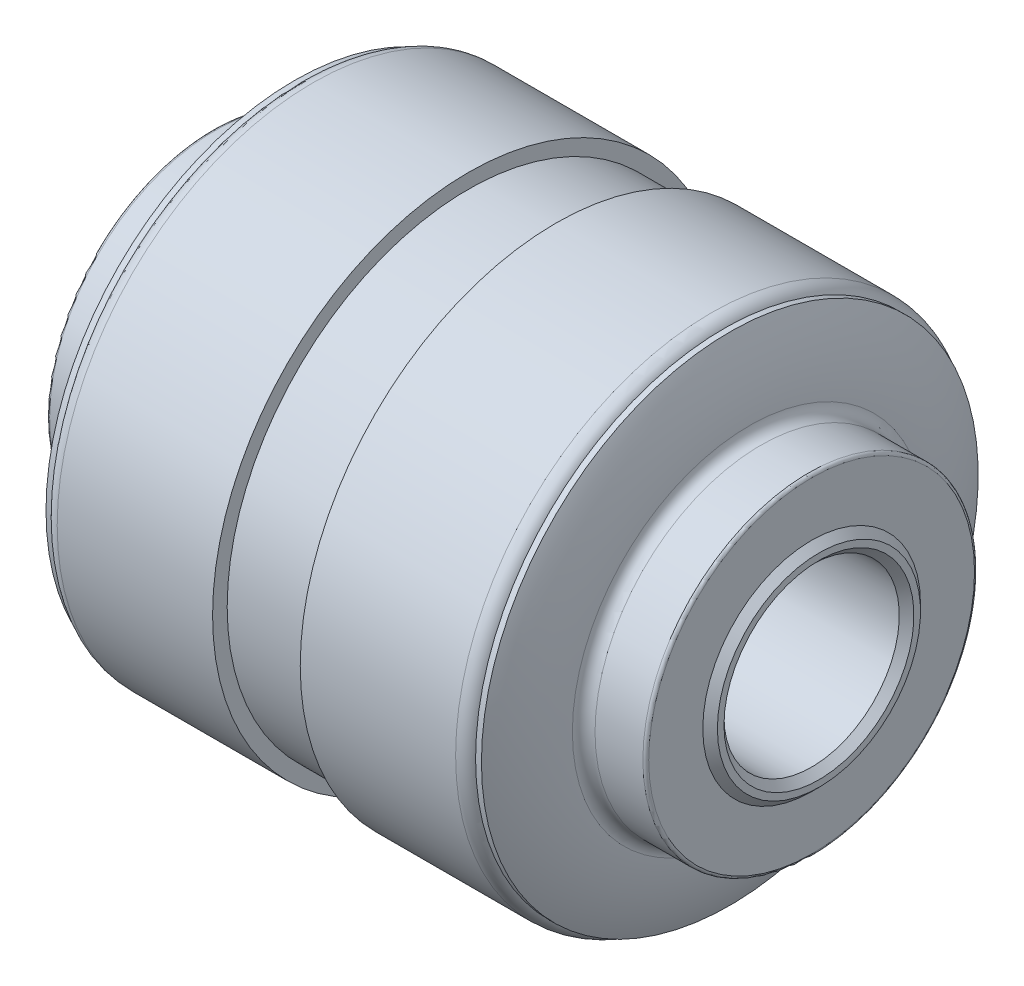
ISO-10303-21;
HEADER;
FILE_DESCRIPTION(('STEP AP214'),'2;1');
FILE_NAME('part.step','',(''),(''),'','','');
FILE_SCHEMA(('AUTOMOTIVE_DESIGN { 1 0 10303 214 1 1 1 1 }'));
ENDSEC;
DATA;
#1=APPLICATION_CONTEXT('core data for automotive mechanical design processes');
#2=APPLICATION_PROTOCOL_DEFINITION('international standard','automotive_design',2000,#1);
#3=PRODUCT_CONTEXT('',#1,'mechanical');
#4=PRODUCT('Part','Part','',(#3));
#5=PRODUCT_RELATED_PRODUCT_CATEGORY('part','',(#4));
#6=PRODUCT_DEFINITION_FORMATION('','',#4);
#7=PRODUCT_DEFINITION_CONTEXT('part definition',#1,'design');
#8=PRODUCT_DEFINITION('design','',#6,#7);
#9=PRODUCT_DEFINITION_SHAPE('','',#8);
#10=(LENGTH_UNIT() NAMED_UNIT(*) SI_UNIT(.MILLI.,.METRE.));
#11=(NAMED_UNIT(*) PLANE_ANGLE_UNIT() SI_UNIT($,.RADIAN.));
#12=(NAMED_UNIT(*) SI_UNIT($,.STERADIAN.) SOLID_ANGLE_UNIT());
#13=UNCERTAINTY_MEASURE_WITH_UNIT(LENGTH_MEASURE(1.E-05),#10,'distance_accuracy_value','');
#14=(GEOMETRIC_REPRESENTATION_CONTEXT(3) GLOBAL_UNCERTAINTY_ASSIGNED_CONTEXT((#13)) GLOBAL_UNIT_ASSIGNED_CONTEXT((#10,
#11,#12)) REPRESENTATION_CONTEXT('',''));
#15=CARTESIAN_POINT('',(0.,0.,0.));
#16=DIRECTION('',(0.,0.,1.));
#17=DIRECTION('',(1.,0.,0.));
#18=AXIS2_PLACEMENT_3D('',#15,#16,#17);
#19=CARTESIAN_POINT('',(88.99,0.,0.));
#20=DIRECTION('',(1.,0.,0.));
#21=DIRECTION('',(0.,0.,1.));
#22=AXIS2_PLACEMENT_3D('',#19,#20,#21);
#23=CYLINDRICAL_SURFACE('',#22,17.);
#24=CARTESIAN_POINT('',(-14.5,0.,0.));
#25=DIRECTION('',(-1.,0.,0.));
#26=DIRECTION('',(0.,0.,1.));
#27=AXIS2_PLACEMENT_3D('',#24,#25,#26);
#28=CIRCLE('',#27,17.);
#29=CARTESIAN_POINT('',(-14.5,0.,17.));
#30=VERTEX_POINT('',#29);
#31=EDGE_CURVE('E113',#30,#30,#28,.T.);
#32=ORIENTED_EDGE('',*,*,#31,.T.);
#33=EDGE_LOOP('',(#32));
#34=FACE_BOUND('',#33,.T.);
#35=CARTESIAN_POINT('',(-14.9002242129923,0.,0.));
#36=DIRECTION('',(1.,0.,0.));
#37=DIRECTION('',(0.,0.,-1.));
#38=AXIS2_PLACEMENT_3D('',#35,#36,#37);
#39=CIRCLE('',#38,17.);
#40=CARTESIAN_POINT('',(-14.9002242129923,0.,-17.));
#41=VERTEX_POINT('',#40);
#42=EDGE_CURVE('E92',#41,#41,#39,.F.);
#43=ORIENTED_EDGE('',*,*,#42,.F.);
#44=EDGE_LOOP('',(#43));
#45=FACE_BOUND('',#44,.T.);
#46=ADVANCED_FACE('F35',(#34,#45),#23,.T.);
#47=CARTESIAN_POINT('',(-88.99,0.,0.));
#48=DIRECTION('',(-1.,0.,0.));
#49=DIRECTION('',(0.,0.,1.));
#50=AXIS2_PLACEMENT_3D('',#47,#48,#49);
#51=CYLINDRICAL_SURFACE('',#50,17.);
#52=CARTESIAN_POINT('',(14.5,0.,0.));
#53=DIRECTION('',(-1.,0.,0.));
#54=DIRECTION('',(0.,0.,1.));
#55=AXIS2_PLACEMENT_3D('',#52,#53,#54);
#56=CIRCLE('',#55,17.);
#57=CARTESIAN_POINT('',(14.5,0.,17.));
#58=VERTEX_POINT('',#57);
#59=EDGE_CURVE('E103',#58,#58,#56,.T.);
#60=ORIENTED_EDGE('',*,*,#59,.F.);
#61=EDGE_LOOP('',(#60));
#62=FACE_BOUND('',#61,.T.);
#63=CARTESIAN_POINT('',(14.9002242129923,0.,0.));
#64=DIRECTION('',(-1.,0.,0.));
#65=DIRECTION('',(0.,0.,1.));
#66=AXIS2_PLACEMENT_3D('',#63,#64,#65);
#67=CIRCLE('',#66,17.);
#68=CARTESIAN_POINT('',(14.9002242129923,0.,17.));
#69=VERTEX_POINT('',#68);
#70=EDGE_CURVE('E96',#69,#69,#67,.F.);
#71=ORIENTED_EDGE('',*,*,#70,.F.);
#72=EDGE_LOOP('',(#71));
#73=FACE_BOUND('',#72,.T.);
#74=ADVANCED_FACE('F142',(#62,#73),#51,.T.);
#75=CARTESIAN_POINT('',(-88.99,0.,0.));
#76=DIRECTION('',(-1.,0.,0.));
#77=DIRECTION('',(0.,0.,1.));
#78=AXIS2_PLACEMENT_3D('',#75,#76,#77);
#79=CYLINDRICAL_SURFACE('',#78,6.);
#80=CARTESIAN_POINT('',(-20.5,0.,0.));
#81=DIRECTION('',(1.,0.,0.));
#82=DIRECTION('',(0.,0.,-1.));
#83=AXIS2_PLACEMENT_3D('',#80,#81,#82);
#84=CIRCLE('',#83,6.);
#85=CARTESIAN_POINT('',(-20.5,0.,-6.));
#86=VERTEX_POINT('',#85);
#87=EDGE_CURVE('E85',#86,#86,#84,.F.);
#88=ORIENTED_EDGE('',*,*,#87,.T.);
#89=EDGE_LOOP('',(#88));
#90=FACE_BOUND('',#89,.T.);
#91=CARTESIAN_POINT('',(20.5,0.,0.));
#92=DIRECTION('',(-1.,0.,0.));
#93=DIRECTION('',(0.,0.,1.));
#94=AXIS2_PLACEMENT_3D('',#91,#92,#93);
#95=CIRCLE('',#94,6.);
#96=CARTESIAN_POINT('',(20.5,0.,6.));
#97=VERTEX_POINT('',#96);
#98=EDGE_CURVE('E88',#97,#97,#95,.F.);
#99=ORIENTED_EDGE('',*,*,#98,.T.);
#100=EDGE_LOOP('',(#99));
#101=FACE_BOUND('',#100,.T.);
#102=ADVANCED_FACE('F148',(#90,#101),#79,.F.);
#103=CARTESIAN_POINT('',(21.,6.,0.));
#104=DIRECTION('',(-1.,0.,0.));
#105=DIRECTION('',(0.,0.,1.));
#106=AXIS2_PLACEMENT_3D('',#103,#104,#105);
#107=PLANE('',#106);
#108=CARTESIAN_POINT('',(21.,0.,0.));
#109=DIRECTION('',(-1.,0.,0.));
#110=DIRECTION('',(0.,0.,1.));
#111=AXIS2_PLACEMENT_3D('',#108,#109,#110);
#112=CIRCLE('',#111,6.49999999999999);
#113=CARTESIAN_POINT('',(21.,0.,6.49999999999999));
#114=VERTEX_POINT('',#113);
#115=EDGE_CURVE('E73',#114,#114,#112,.T.);
#116=ORIENTED_EDGE('',*,*,#115,.T.);
#117=EDGE_LOOP('',(#116));
#118=FACE_BOUND('',#117,.T.);
#119=CARTESIAN_POINT('',(21.,0.,0.));
#120=DIRECTION('',(-1.,0.,0.));
#121=DIRECTION('',(0.,0.,1.));
#122=AXIS2_PLACEMENT_3D('',#119,#120,#121);
#123=CIRCLE('',#122,6.94999999999999);
#124=CARTESIAN_POINT('',(21.,0.,6.94999999999999));
#125=VERTEX_POINT('',#124);
#126=EDGE_CURVE('E76',#125,#125,#123,.F.);
#127=ORIENTED_EDGE('',*,*,#126,.T.);
#128=EDGE_LOOP('',(#127));
#129=FACE_BOUND('',#128,.T.);
#130=ADVANCED_FACE('F323',(#118,#129),#107,.F.);
#131=CARTESIAN_POINT('',(20.5,7.45,0.));
#132=DIRECTION('',(-1.,0.,0.));
#133=DIRECTION('',(0.,0.,1.));
#134=AXIS2_PLACEMENT_3D('',#131,#132,#133);
#135=PLANE('',#134);
#136=CARTESIAN_POINT('',(20.5,0.,0.));
#137=DIRECTION('',(-1.,0.,0.));
#138=DIRECTION('',(0.,0.,1.));
#139=AXIS2_PLACEMENT_3D('',#136,#137,#138);
#140=CIRCLE('',#139,11.15);
#141=CARTESIAN_POINT('',(20.5,0.,11.15));
#142=VERTEX_POINT('',#141);
#143=EDGE_CURVE('E61',#142,#142,#140,.F.);
#144=ORIENTED_EDGE('',*,*,#143,.T.);
#145=EDGE_LOOP('',(#144));
#146=FACE_BOUND('',#145,.T.);
#147=CARTESIAN_POINT('',(20.5,0.,0.));
#148=DIRECTION('',(-1.,0.,0.));
#149=DIRECTION('',(0.,0.,1.));
#150=AXIS2_PLACEMENT_3D('',#147,#148,#149);
#151=CIRCLE('',#150,7.45);
#152=CARTESIAN_POINT('',(20.5,0.,7.45));
#153=VERTEX_POINT('',#152);
#154=EDGE_CURVE('E91',#153,#153,#151,.T.);
#155=ORIENTED_EDGE('',*,*,#154,.T.);
#156=EDGE_LOOP('',(#155));
#157=FACE_BOUND('',#156,.T.);
#158=ADVANCED_FACE('F295',(#146,#157),#135,.F.);
#159=CARTESIAN_POINT('',(-88.99,0.,0.));
#160=DIRECTION('',(-1.,0.,0.));
#161=DIRECTION('',(0.,0.,1.));
#162=AXIS2_PLACEMENT_3D('',#159,#160,#161);
#163=CYLINDRICAL_SURFACE('',#162,11.35);
#164=CARTESIAN_POINT('',(17.0259180473517,0.,0.));
#165=DIRECTION('',(-1.,0.,0.));
#166=DIRECTION('',(0.,0.,1.));
#167=AXIS2_PLACEMENT_3D('',#164,#165,#166);
#168=CIRCLE('',#167,11.35);
#169=CARTESIAN_POINT('',(17.0259180473517,0.,11.35));
#170=VERTEX_POINT('',#169);
#171=EDGE_CURVE('E46',#170,#170,#168,.F.);
#172=ORIENTED_EDGE('',*,*,#171,.T.);
#173=EDGE_LOOP('',(#172));
#174=FACE_BOUND('',#173,.T.);
#175=CARTESIAN_POINT('',(20.3,0.,0.));
#176=DIRECTION('',(-1.,0.,0.));
#177=DIRECTION('',(0.,0.,1.));
#178=AXIS2_PLACEMENT_3D('',#175,#176,#177);
#179=CIRCLE('',#178,11.35);
#180=CARTESIAN_POINT('',(20.3,0.,11.35));
#181=VERTEX_POINT('',#180);
#182=EDGE_CURVE('E64',#181,#181,#179,.T.);
#183=ORIENTED_EDGE('',*,*,#182,.T.);
#184=EDGE_LOOP('',(#183));
#185=FACE_BOUND('',#184,.T.);
#186=ADVANCED_FACE('F248',(#174,#185),#163,.T.);
#187=CARTESIAN_POINT('',(-88.99,0.,0.));
#188=DIRECTION('',(-1.,0.,0.));
#189=DIRECTION('',(0.,0.,1.));
#190=AXIS2_PLACEMENT_3D('',#187,#188,#189);
#191=CYLINDRICAL_SURFACE('',#190,17.5);
#192=CARTESIAN_POINT('',(13.6339745962156,0.,0.));
#193=DIRECTION('',(1.,0.,0.));
#194=DIRECTION('',(0.,0.,-1.));
#195=AXIS2_PLACEMENT_3D('',#192,#193,#194);
#196=CIRCLE('',#195,17.5);
#197=CARTESIAN_POINT('',(13.6339745962156,0.,-17.5));
#198=VERTEX_POINT('',#197);
#199=EDGE_CURVE('E42',#198,#198,#196,.F.);
#200=ORIENTED_EDGE('',*,*,#199,.T.);
#201=EDGE_LOOP('',(#200));
#202=FACE_BOUND('',#201,.T.);
#203=CARTESIAN_POINT('',(3.,0.,0.));
#204=DIRECTION('',(-1.,0.,0.));
#205=DIRECTION('',(0.,0.,1.));
#206=AXIS2_PLACEMENT_3D('',#203,#204,#205);
#207=CIRCLE('',#206,17.5);
#208=CARTESIAN_POINT('',(3.,0.,17.5));
#209=VERTEX_POINT('',#208);
#210=EDGE_CURVE('E106',#209,#209,#207,.T.);
#211=ORIENTED_EDGE('',*,*,#210,.F.);
#212=EDGE_LOOP('',(#211));
#213=FACE_BOUND('',#212,.T.);
#214=ADVANCED_FACE('F138',(#202,#213),#191,.T.);
#215=CARTESIAN_POINT('',(3.,17.5,0.));
#216=DIRECTION('',(1.,0.,0.));
#217=DIRECTION('',(0.,0.,-1.));
#218=AXIS2_PLACEMENT_3D('',#215,#216,#217);
#219=PLANE('',#218);
#220=CARTESIAN_POINT('',(3.,0.,0.));
#221=DIRECTION('',(-1.,0.,0.));
#222=DIRECTION('',(0.,0.,1.));
#223=AXIS2_PLACEMENT_3D('',#220,#221,#222);
#224=CIRCLE('',#223,16.5);
#225=CARTESIAN_POINT('',(3.,0.,16.5));
#226=VERTEX_POINT('',#225);
#227=EDGE_CURVE('E99',#226,#226,#224,.T.);
#228=ORIENTED_EDGE('',*,*,#227,.F.);
#229=EDGE_LOOP('',(#228));
#230=FACE_BOUND('',#229,.T.);
#231=ORIENTED_EDGE('',*,*,#210,.T.);
#232=EDGE_LOOP('',(#231));
#233=FACE_BOUND('',#232,.T.);
#234=ADVANCED_FACE('F128',(#230,#233),#219,.F.);
#235=CARTESIAN_POINT('',(-88.99,0.,0.));
#236=DIRECTION('',(-1.,0.,0.));
#237=DIRECTION('',(0.,0.,1.));
#238=AXIS2_PLACEMENT_3D('',#235,#236,#237);
#239=CYLINDRICAL_SURFACE('',#238,16.5);
#240=ORIENTED_EDGE('',*,*,#227,.T.);
#241=EDGE_LOOP('',(#240));
#242=FACE_BOUND('',#241,.T.);
#243=CARTESIAN_POINT('',(-3.,0.,0.));
#244=DIRECTION('',(-1.,0.,0.));
#245=DIRECTION('',(0.,0.,1.));
#246=AXIS2_PLACEMENT_3D('',#243,#244,#245);
#247=CIRCLE('',#246,16.5);
#248=CARTESIAN_POINT('',(-3.,0.,16.5));
#249=VERTEX_POINT('',#248);
#250=EDGE_CURVE('E95',#249,#249,#247,.T.);
#251=ORIENTED_EDGE('',*,*,#250,.F.);
#252=EDGE_LOOP('',(#251));
#253=FACE_BOUND('',#252,.T.);
#254=ADVANCED_FACE('F125',(#242,#253),#239,.T.);
#255=CARTESIAN_POINT('',(3.75,0.,0.));
#256=DIRECTION('',(-1.,0.,0.));
#257=DIRECTION('',(0.,0.,1.));
#258=AXIS2_PLACEMENT_3D('',#255,#256,#257);
#259=DEGENERATE_TOROIDAL_SURFACE('',#258,11.35,12.5,.T.);
#260=CARTESIAN_POINT('',(16.2273665858573,0.,0.));
#261=DIRECTION('',(-1.,0.,0.));
#262=DIRECTION('',(0.,0.,1.));
#263=AXIS2_PLACEMENT_3D('',#260,#261,#262);
#264=CIRCLE('',#263,12.1018796992481);
#265=CARTESIAN_POINT('',(16.2273665858573,0.,12.1018796992481));
#266=VERTEX_POINT('',#265);
#267=EDGE_CURVE('E50',#266,#266,#264,.T.);
#268=ORIENTED_EDGE('',*,*,#267,.T.);
#269=EDGE_LOOP('',(#268));
#270=FACE_BOUND('',#269,.T.);
#271=ORIENTED_EDGE('',*,*,#70,.T.);
#272=EDGE_LOOP('',(#271));
#273=FACE_BOUND('',#272,.T.);
#274=ADVANCED_FACE('F127',(#270,#273),#259,.T.);
#275=CARTESIAN_POINT('',(-21.,6.,0.));
#276=DIRECTION('',(1.,0.,0.));
#277=DIRECTION('',(0.,0.,1.));
#278=AXIS2_PLACEMENT_3D('',#275,#276,#277);
#279=PLANE('',#278);
#280=CARTESIAN_POINT('',(-21.,0.,0.));
#281=DIRECTION('',(1.,0.,0.));
#282=DIRECTION('',(0.,0.,-1.));
#283=AXIS2_PLACEMENT_3D('',#280,#281,#282);
#284=CIRCLE('',#283,6.5);
#285=CARTESIAN_POINT('',(-21.,0.,-6.5));
#286=VERTEX_POINT('',#285);
#287=EDGE_CURVE('E79',#286,#286,#284,.T.);
#288=ORIENTED_EDGE('',*,*,#287,.T.);
#289=EDGE_LOOP('',(#288));
#290=FACE_BOUND('',#289,.T.);
#291=CARTESIAN_POINT('',(-21.,0.,0.));
#292=DIRECTION('',(1.,0.,0.));
#293=DIRECTION('',(0.,0.,-1.));
#294=AXIS2_PLACEMENT_3D('',#291,#292,#293);
#295=CIRCLE('',#294,6.95);
#296=CARTESIAN_POINT('',(-21.,0.,-6.95));
#297=VERTEX_POINT('',#296);
#298=EDGE_CURVE('E82',#297,#297,#295,.F.);
#299=ORIENTED_EDGE('',*,*,#298,.T.);
#300=EDGE_LOOP('',(#299));
#301=FACE_BOUND('',#300,.T.);
#302=ADVANCED_FACE('F135',(#290,#301),#279,.F.);
#303=CARTESIAN_POINT('',(-20.5,7.45,0.));
#304=DIRECTION('',(1.,0.,0.));
#305=DIRECTION('',(0.,0.,1.));
#306=AXIS2_PLACEMENT_3D('',#303,#304,#305);
#307=PLANE('',#306);
#308=CARTESIAN_POINT('',(-20.5,0.,0.));
#309=DIRECTION('',(1.,0.,0.));
#310=DIRECTION('',(0.,0.,-1.));
#311=AXIS2_PLACEMENT_3D('',#308,#309,#310);
#312=CIRCLE('',#311,11.15);
#313=CARTESIAN_POINT('',(-20.5,0.,-11.15));
#314=VERTEX_POINT('',#313);
#315=EDGE_CURVE('E70',#314,#314,#312,.F.);
#316=ORIENTED_EDGE('',*,*,#315,.T.);
#317=EDGE_LOOP('',(#316));
#318=FACE_BOUND('',#317,.T.);
#319=CARTESIAN_POINT('',(-20.5,0.,0.));
#320=DIRECTION('',(-1.,0.,0.));
#321=DIRECTION('',(0.,0.,1.));
#322=AXIS2_PLACEMENT_3D('',#319,#320,#321);
#323=CIRCLE('',#322,7.45);
#324=CARTESIAN_POINT('',(-20.5,0.,7.45));
#325=VERTEX_POINT('',#324);
#326=EDGE_CURVE('E100',#325,#325,#323,.T.);
#327=ORIENTED_EDGE('',*,*,#326,.F.);
#328=EDGE_LOOP('',(#327));
#329=FACE_BOUND('',#328,.T.);
#330=ADVANCED_FACE('F159',(#318,#329),#307,.F.);
#331=CARTESIAN_POINT('',(88.99,0.,0.));
#332=DIRECTION('',(1.,0.,0.));
#333=DIRECTION('',(0.,0.,1.));
#334=AXIS2_PLACEMENT_3D('',#331,#332,#333);
#335=CYLINDRICAL_SURFACE('',#334,11.35);
#336=CARTESIAN_POINT('',(-17.0259180473517,0.,0.));
#337=DIRECTION('',(-1.,0.,0.));
#338=DIRECTION('',(0.,0.,1.));
#339=AXIS2_PLACEMENT_3D('',#336,#337,#338);
#340=CIRCLE('',#339,11.35);
#341=CARTESIAN_POINT('',(-17.0259180473517,0.,11.35));
#342=VERTEX_POINT('',#341);
#343=EDGE_CURVE('E58',#342,#342,#340,.T.);
#344=ORIENTED_EDGE('',*,*,#343,.T.);
#345=EDGE_LOOP('',(#344));
#346=FACE_BOUND('',#345,.T.);
#347=CARTESIAN_POINT('',(-20.3,0.,0.));
#348=DIRECTION('',(1.,0.,0.));
#349=DIRECTION('',(0.,0.,-1.));
#350=AXIS2_PLACEMENT_3D('',#347,#348,#349);
#351=CIRCLE('',#350,11.35);
#352=CARTESIAN_POINT('',(-20.3,0.,-11.35));
#353=VERTEX_POINT('',#352);
#354=EDGE_CURVE('E67',#353,#353,#351,.T.);
#355=ORIENTED_EDGE('',*,*,#354,.T.);
#356=EDGE_LOOP('',(#355));
#357=FACE_BOUND('',#356,.T.);
#358=ADVANCED_FACE('F156',(#346,#357),#335,.T.);
#359=CARTESIAN_POINT('',(88.99,0.,0.));
#360=DIRECTION('',(1.,0.,0.));
#361=DIRECTION('',(0.,0.,1.));
#362=AXIS2_PLACEMENT_3D('',#359,#360,#361);
#363=CYLINDRICAL_SURFACE('',#362,17.5);
#364=CARTESIAN_POINT('',(-13.6339745962156,0.,0.));
#365=DIRECTION('',(-1.,0.,0.));
#366=DIRECTION('',(0.,0.,1.));
#367=AXIS2_PLACEMENT_3D('',#364,#365,#366);
#368=CIRCLE('',#367,17.5);
#369=CARTESIAN_POINT('',(-13.6339745962156,0.,17.5));
#370=VERTEX_POINT('',#369);
#371=EDGE_CURVE('E11',#370,#370,#368,.F.);
#372=ORIENTED_EDGE('',*,*,#371,.T.);
#373=EDGE_LOOP('',(#372));
#374=FACE_BOUND('',#373,.T.);
#375=CARTESIAN_POINT('',(-3.,0.,0.));
#376=DIRECTION('',(-1.,0.,0.));
#377=DIRECTION('',(0.,0.,1.));
#378=AXIS2_PLACEMENT_3D('',#375,#376,#377);
#379=CIRCLE('',#378,17.5);
#380=CARTESIAN_POINT('',(-3.,0.,17.5));
#381=VERTEX_POINT('',#380);
#382=EDGE_CURVE('E116',#381,#381,#379,.T.);
#383=ORIENTED_EDGE('',*,*,#382,.T.);
#384=EDGE_LOOP('',(#383));
#385=FACE_BOUND('',#384,.T.);
#386=ADVANCED_FACE('F154',(#374,#385),#363,.T.);
#387=CARTESIAN_POINT('',(-3.,17.5,0.));
#388=DIRECTION('',(-1.,0.,0.));
#389=DIRECTION('',(0.,0.,-1.));
#390=AXIS2_PLACEMENT_3D('',#387,#388,#389);
#391=PLANE('',#390);
#392=ORIENTED_EDGE('',*,*,#250,.T.);
#393=EDGE_LOOP('',(#392));
#394=FACE_BOUND('',#393,.T.);
#395=ORIENTED_EDGE('',*,*,#382,.F.);
#396=EDGE_LOOP('',(#395));
#397=FACE_BOUND('',#396,.T.);
#398=ADVANCED_FACE('F122',(#394,#397),#391,.F.);
#399=CARTESIAN_POINT('',(-3.75,0.,0.));
#400=DIRECTION('',(1.,0.,0.));
#401=DIRECTION('',(0.,0.,1.));
#402=AXIS2_PLACEMENT_3D('',#399,#400,#401);
#403=DEGENERATE_TOROIDAL_SURFACE('',#402,11.35,12.5,.T.);
#404=CARTESIAN_POINT('',(-16.2273665858573,0.,0.));
#405=DIRECTION('',(1.,0.,0.));
#406=DIRECTION('',(0.,0.,-1.));
#407=AXIS2_PLACEMENT_3D('',#404,#405,#406);
#408=CIRCLE('',#407,12.1018796992481);
#409=CARTESIAN_POINT('',(-16.2273665858573,0.,-12.1018796992481));
#410=VERTEX_POINT('',#409);
#411=EDGE_CURVE('E55',#410,#410,#408,.T.);
#412=ORIENTED_EDGE('',*,*,#411,.T.);
#413=EDGE_LOOP('',(#412));
#414=FACE_BOUND('',#413,.T.);
#415=ORIENTED_EDGE('',*,*,#42,.T.);
#416=EDGE_LOOP('',(#415));
#417=FACE_BOUND('',#416,.T.);
#418=ADVANCED_FACE('F185',(#414,#417),#403,.T.);
#419=CARTESIAN_POINT('',(-20.5,0.,0.));
#420=DIRECTION('',(-1.,0.,0.));
#421=DIRECTION('',(0.,0.,1.));
#422=AXIS2_PLACEMENT_3D('',#419,#420,#421);
#423=CONICAL_SURFACE('',#422,6.,0.785398163397447);
#424=ORIENTED_EDGE('',*,*,#287,.F.);
#425=EDGE_LOOP('',(#424));
#426=FACE_BOUND('',#425,.T.);
#427=ORIENTED_EDGE('',*,*,#87,.F.);
#428=EDGE_LOOP('',(#427));
#429=FACE_BOUND('',#428,.T.);
#430=ADVANCED_FACE('F175',(#426,#429),#423,.F.);
#431=CARTESIAN_POINT('',(-21.,0.,0.));
#432=DIRECTION('',(1.,0.,0.));
#433=DIRECTION('',(0.,0.,-1.));
#434=AXIS2_PLACEMENT_3D('',#431,#432,#433);
#435=CONICAL_SURFACE('',#434,6.95,0.78539816339745);
#436=ORIENTED_EDGE('',*,*,#326,.T.);
#437=EDGE_LOOP('',(#436));
#438=FACE_BOUND('',#437,.T.);
#439=ORIENTED_EDGE('',*,*,#298,.F.);
#440=EDGE_LOOP('',(#439));
#441=FACE_BOUND('',#440,.T.);
#442=ADVANCED_FACE('F172',(#438,#441),#435,.T.);
#443=CARTESIAN_POINT('',(21.,0.,0.));
#444=DIRECTION('',(1.,0.,0.));
#445=DIRECTION('',(0.,0.,-1.));
#446=AXIS2_PLACEMENT_3D('',#443,#444,#445);
#447=CONICAL_SURFACE('',#446,6.5,0.785398163397446);
#448=ORIENTED_EDGE('',*,*,#98,.F.);
#449=EDGE_LOOP('',(#448));
#450=FACE_BOUND('',#449,.T.);
#451=ORIENTED_EDGE('',*,*,#115,.F.);
#452=EDGE_LOOP('',(#451));
#453=FACE_BOUND('',#452,.T.);
#454=ADVANCED_FACE('F174',(#450,#453),#447,.F.);
#455=CARTESIAN_POINT('',(20.5,0.,0.));
#456=DIRECTION('',(-1.,0.,0.));
#457=DIRECTION('',(0.,0.,1.));
#458=AXIS2_PLACEMENT_3D('',#455,#456,#457);
#459=CONICAL_SURFACE('',#458,7.45,0.78539816339745);
#460=ORIENTED_EDGE('',*,*,#126,.F.);
#461=EDGE_LOOP('',(#460));
#462=FACE_BOUND('',#461,.T.);
#463=ORIENTED_EDGE('',*,*,#154,.F.);
#464=EDGE_LOOP('',(#463));
#465=FACE_BOUND('',#464,.T.);
#466=ADVANCED_FACE('F182',(#462,#465),#459,.T.);
#467=CARTESIAN_POINT('',(-20.3,0.,0.));
#468=DIRECTION('',(1.,0.,0.));
#469=DIRECTION('',(0.,0.,-1.));
#470=AXIS2_PLACEMENT_3D('',#467,#468,#469);
#471=TOROIDAL_SURFACE('',#470,11.15,0.2);
#472=ORIENTED_EDGE('',*,*,#354,.F.);
#473=EDGE_LOOP('',(#472));
#474=FACE_BOUND('',#473,.T.);
#475=ORIENTED_EDGE('',*,*,#315,.F.);
#476=EDGE_LOOP('',(#475));
#477=FACE_BOUND('',#476,.T.);
#478=ADVANCED_FACE('F192',(#474,#477),#471,.T.);
#479=CARTESIAN_POINT('',(20.3,0.,0.));
#480=DIRECTION('',(-1.,0.,0.));
#481=DIRECTION('',(0.,0.,1.));
#482=AXIS2_PLACEMENT_3D('',#479,#480,#481);
#483=TOROIDAL_SURFACE('',#482,11.15,0.2);
#484=ORIENTED_EDGE('',*,*,#143,.F.);
#485=EDGE_LOOP('',(#484));
#486=FACE_BOUND('',#485,.T.);
#487=ORIENTED_EDGE('',*,*,#182,.F.);
#488=EDGE_LOOP('',(#487));
#489=FACE_BOUND('',#488,.T.);
#490=ADVANCED_FACE('F196',(#486,#489),#483,.T.);
#491=CARTESIAN_POINT('',(-17.0259180473518,0.,0.));
#492=DIRECTION('',(-1.,0.,0.));
#493=DIRECTION('',(0.,0.,1.));
#494=AXIS2_PLACEMENT_3D('',#491,#492,#493);
#495=TOROIDAL_SURFACE('',#494,12.15,0.8);
#496=ORIENTED_EDGE('',*,*,#411,.F.);
#497=EDGE_LOOP('',(#496));
#498=FACE_BOUND('',#497,.T.);
#499=ORIENTED_EDGE('',*,*,#343,.F.);
#500=EDGE_LOOP('',(#499));
#501=FACE_BOUND('',#500,.T.);
#502=ADVANCED_FACE('F200',(#498,#501),#495,.F.);
#503=CARTESIAN_POINT('',(17.0259180473518,0.,0.));
#504=DIRECTION('',(-1.,0.,0.));
#505=DIRECTION('',(0.,0.,1.));
#506=AXIS2_PLACEMENT_3D('',#503,#504,#505);
#507=TOROIDAL_SURFACE('',#506,12.15,0.8);
#508=ORIENTED_EDGE('',*,*,#171,.F.);
#509=EDGE_LOOP('',(#508));
#510=FACE_BOUND('',#509,.T.);
#511=ORIENTED_EDGE('',*,*,#267,.F.);
#512=EDGE_LOOP('',(#511));
#513=FACE_BOUND('',#512,.T.);
#514=ADVANCED_FACE('F204',(#510,#513),#507,.F.);
#515=CARTESIAN_POINT('',(13.6339745962156,0.,0.));
#516=DIRECTION('',(1.,0.,0.));
#517=DIRECTION('',(0.,0.,-1.));
#518=AXIS2_PLACEMENT_3D('',#515,#516,#517);
#519=TOROIDAL_SURFACE('',#518,16.5,1.);
#520=ORIENTED_EDGE('',*,*,#59,.T.);
#521=EDGE_LOOP('',(#520));
#522=FACE_BOUND('',#521,.T.);
#523=ORIENTED_EDGE('',*,*,#199,.F.);
#524=EDGE_LOOP('',(#523));
#525=FACE_BOUND('',#524,.T.);
#526=ADVANCED_FACE('F207',(#522,#525),#519,.T.);
#527=CARTESIAN_POINT('',(-13.6339745962156,0.,0.));
#528=DIRECTION('',(-1.,0.,0.));
#529=DIRECTION('',(0.,0.,1.));
#530=AXIS2_PLACEMENT_3D('',#527,#528,#529);
#531=TOROIDAL_SURFACE('',#530,16.5,1.);
#532=ORIENTED_EDGE('',*,*,#371,.F.);
#533=EDGE_LOOP('',(#532));
#534=FACE_BOUND('',#533,.T.);
#535=ORIENTED_EDGE('',*,*,#31,.F.);
#536=EDGE_LOOP('',(#535));
#537=FACE_BOUND('',#536,.T.);
#538=ADVANCED_FACE('F37',(#534,#537),#531,.T.);
#539=CLOSED_SHELL('',(#46,#74,#102,#130,#158,#186,#214,#234,#254,#274,#302,#330,#358,#386,#398,
#418,#430,#442,#454,#466,#478,#490,#502,#514,#526,#538));
#540=MANIFOLD_SOLID_BREP('B2',#539);
#541=ADVANCED_BREP_SHAPE_REPRESENTATION('',(#18,#540),#14);
#542=SHAPE_DEFINITION_REPRESENTATION(#9,#541);
ENDSEC;
END-ISO-10303-21;
